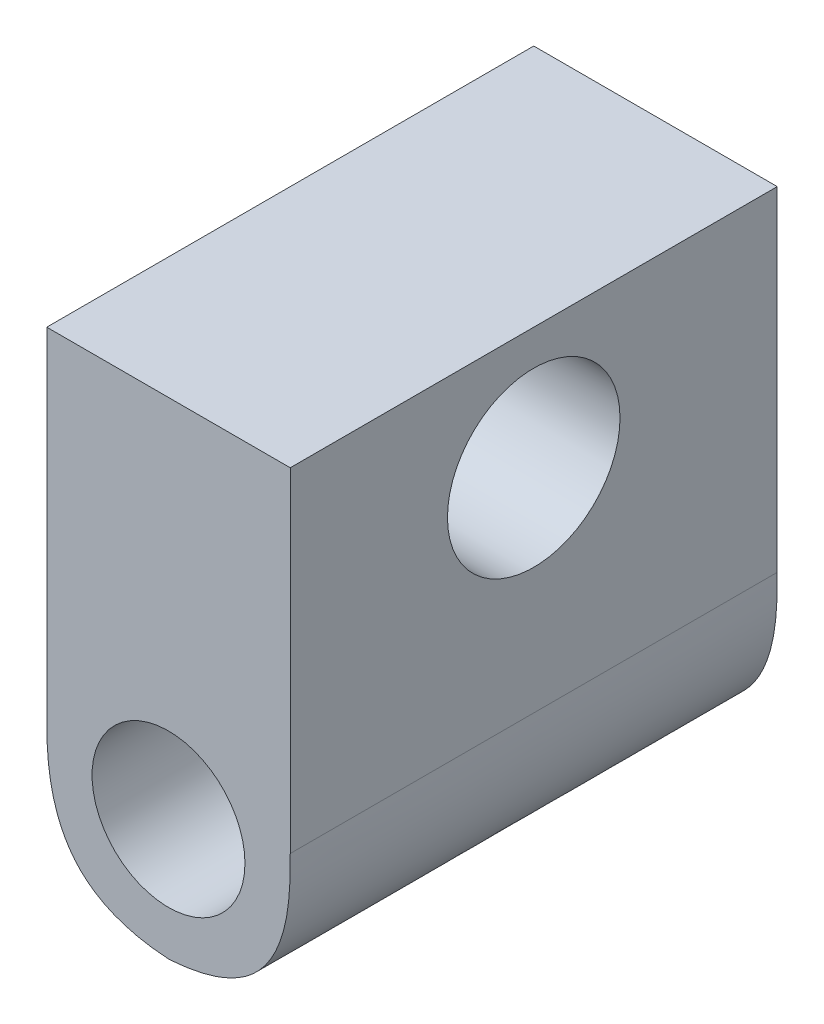
ISO-10303-21;
HEADER;
FILE_DESCRIPTION(('STEP AP214'),'2;1');
FILE_NAME('part.step','',(''),(''),'','','');
FILE_SCHEMA(('AUTOMOTIVE_DESIGN { 1 0 10303 214 1 1 1 1 }'));
ENDSEC;
DATA;
#1=APPLICATION_CONTEXT('core data for automotive mechanical design processes');
#2=APPLICATION_PROTOCOL_DEFINITION('international standard','automotive_design',2000,#1);
#3=PRODUCT_CONTEXT('',#1,'mechanical');
#4=PRODUCT('Part','Part','',(#3));
#5=PRODUCT_RELATED_PRODUCT_CATEGORY('part','',(#4));
#6=PRODUCT_DEFINITION_FORMATION('','',#4);
#7=PRODUCT_DEFINITION_CONTEXT('part definition',#1,'design');
#8=PRODUCT_DEFINITION('design','',#6,#7);
#9=PRODUCT_DEFINITION_SHAPE('','',#8);
#10=(LENGTH_UNIT() NAMED_UNIT(*) SI_UNIT(.MILLI.,.METRE.));
#11=(NAMED_UNIT(*) PLANE_ANGLE_UNIT() SI_UNIT($,.RADIAN.));
#12=(NAMED_UNIT(*) SI_UNIT($,.STERADIAN.) SOLID_ANGLE_UNIT());
#13=UNCERTAINTY_MEASURE_WITH_UNIT(LENGTH_MEASURE(1.E-05),#10,'distance_accuracy_value','');
#14=(GEOMETRIC_REPRESENTATION_CONTEXT(3) GLOBAL_UNCERTAINTY_ASSIGNED_CONTEXT((#13)) GLOBAL_UNIT_ASSIGNED_CONTEXT((#10,
#11,#12)) REPRESENTATION_CONTEXT('',''));
#15=CARTESIAN_POINT('',(0.,0.,0.));
#16=DIRECTION('',(0.,0.,1.));
#17=DIRECTION('',(1.,0.,0.));
#18=AXIS2_PLACEMENT_3D('',#15,#16,#17);
#19=CARTESIAN_POINT('',(-6.35,0.,-25.4));
#20=DIRECTION('',(1.,0.,0.));
#21=DIRECTION('',(0.,0.,-1.));
#22=AXIS2_PLACEMENT_3D('',#19,#20,#21);
#23=PLANE('',#22);
#24=CARTESIAN_POINT('',(-6.35,12.7,-12.7));
#25=DIRECTION('',(-1.,0.,0.));
#26=DIRECTION('',(0.,0.,1.));
#27=AXIS2_PLACEMENT_3D('',#24,#25,#26);
#28=CIRCLE('',#27,4.49961);
#29=CARTESIAN_POINT('',(-6.35,12.7,-8.20039));
#30=VERTEX_POINT('',#29);
#31=EDGE_CURVE('E177',#30,#30,#28,.T.);
#32=ORIENTED_EDGE('',*,*,#31,.F.);
#33=EDGE_LOOP('',(#32));
#34=FACE_BOUND('',#33,.T.);
#35=DIRECTION('',(0.,1.,0.));
#36=VECTOR('',#35,1.);
#37=CARTESIAN_POINT('',(-6.35,0.,-25.4));
#38=LINE('',#37,#36);
#39=CARTESIAN_POINT('',(-6.35,1.6256,-25.4));
#40=VERTEX_POINT('',#39);
#41=CARTESIAN_POINT('',(-6.35,19.05,-25.4));
#42=VERTEX_POINT('',#41);
#43=EDGE_CURVE('E99',#40,#42,#38,.T.);
#44=ORIENTED_EDGE('',*,*,#43,.F.);
#45=CARTESIAN_POINT('',(-6.35,1.6256,1.27));
#46=CARTESIAN_POINT('',(-6.35,1.6256,-8.04333333333333));
#47=CARTESIAN_POINT('',(-6.35,1.6256,-17.3566666666566));
#48=CARTESIAN_POINT('',(-6.35,1.6256,-26.67));
#49=B_SPLINE_CURVE_WITH_KNOTS('',3,(#45,#46,#47,#48),.UNSPECIFIED.,.F.,.F.,(4,4),(-0.02667,
0.00127),.UNSPECIFIED.);
#50=CARTESIAN_POINT('',(-6.35,1.6256,0.));
#51=VERTEX_POINT('',#50);
#52=EDGE_CURVE('E115',#40,#51,#49,.F.);
#53=ORIENTED_EDGE('',*,*,#52,.T.);
#54=DIRECTION('',(0.,1.,0.));
#55=VECTOR('',#54,1.);
#56=CARTESIAN_POINT('',(-6.35,0.,0.));
#57=LINE('',#56,#55);
#58=CARTESIAN_POINT('',(-6.35,19.05,0.));
#59=VERTEX_POINT('',#58);
#60=EDGE_CURVE('E121',#51,#59,#57,.T.);
#61=ORIENTED_EDGE('',*,*,#60,.T.);
#62=DIRECTION('',(0.,0.,1.));
#63=VECTOR('',#62,1.);
#64=CARTESIAN_POINT('',(-6.35,19.05,-25.4));
#65=LINE('',#64,#63);
#66=EDGE_CURVE('E113',#42,#59,#65,.T.);
#67=ORIENTED_EDGE('',*,*,#66,.F.);
#68=EDGE_LOOP('',(#44,#53,#61,#67));
#69=FACE_BOUND('',#68,.T.);
#70=ADVANCED_FACE('F40',(#34,#69),#23,.F.);
#71=CARTESIAN_POINT('',(0.,19.05,-25.4));
#72=DIRECTION('',(0.,-1.,0.));
#73=DIRECTION('',(0.,0.,-1.));
#74=AXIS2_PLACEMENT_3D('',#71,#72,#73);
#75=PLANE('',#74);
#76=DIRECTION('',(1.,0.,0.));
#77=VECTOR('',#76,1.);
#78=CARTESIAN_POINT('',(0.,19.05,0.));
#79=LINE('',#78,#77);
#80=CARTESIAN_POINT('',(6.35,19.05,0.));
#81=VERTEX_POINT('',#80);
#82=EDGE_CURVE('E112',#59,#81,#79,.T.);
#83=ORIENTED_EDGE('',*,*,#82,.T.);
#84=DIRECTION('',(0.,0.,1.));
#85=VECTOR('',#84,1.);
#86=CARTESIAN_POINT('',(6.35,19.05,-25.4));
#87=LINE('',#86,#85);
#88=CARTESIAN_POINT('',(6.35,19.05,-25.4));
#89=VERTEX_POINT('',#88);
#90=EDGE_CURVE('E96',#89,#81,#87,.T.);
#91=ORIENTED_EDGE('',*,*,#90,.F.);
#92=DIRECTION('',(1.,0.,0.));
#93=VECTOR('',#92,1.);
#94=CARTESIAN_POINT('',(0.,19.05,-25.4));
#95=LINE('',#94,#93);
#96=EDGE_CURVE('E98',#42,#89,#95,.T.);
#97=ORIENTED_EDGE('',*,*,#96,.F.);
#98=ORIENTED_EDGE('',*,*,#66,.T.);
#99=EDGE_LOOP('',(#83,#91,#97,#98));
#100=FACE_BOUND('',#99,.T.);
#101=ADVANCED_FACE('F110',(#100),#75,.F.);
#102=CARTESIAN_POINT('',(6.35,0.,-25.4));
#103=DIRECTION('',(1.,0.,0.));
#104=DIRECTION('',(0.,0.,-1.));
#105=AXIS2_PLACEMENT_3D('',#102,#103,#104);
#106=PLANE('',#105);
#107=CARTESIAN_POINT('',(6.35,12.7,-12.7));
#108=DIRECTION('',(1.,0.,0.));
#109=DIRECTION('',(0.,0.,-1.));
#110=AXIS2_PLACEMENT_3D('',#107,#108,#109);
#111=CIRCLE('',#110,4.49961);
#112=CARTESIAN_POINT('',(6.35,12.7,-17.19961));
#113=VERTEX_POINT('',#112);
#114=EDGE_CURVE('E125',#113,#113,#111,.F.);
#115=ORIENTED_EDGE('',*,*,#114,.T.);
#116=EDGE_LOOP('',(#115));
#117=FACE_BOUND('',#116,.T.);
#118=DIRECTION('',(0.,1.,0.));
#119=VECTOR('',#118,1.);
#120=CARTESIAN_POINT('',(6.35,0.,0.));
#121=LINE('',#120,#119);
#122=CARTESIAN_POINT('',(6.35,1.6256,0.));
#123=VERTEX_POINT('',#122);
#124=EDGE_CURVE('E124',#123,#81,#121,.T.);
#125=ORIENTED_EDGE('',*,*,#124,.F.);
#126=CARTESIAN_POINT('',(6.35,1.6256,-26.67));
#127=CARTESIAN_POINT('',(6.35,1.6256,-17.3566666666404));
#128=CARTESIAN_POINT('',(6.35,1.6256,-8.04333333333333));
#129=CARTESIAN_POINT('',(6.35,1.6256,1.27));
#130=B_SPLINE_CURVE_WITH_KNOTS('',3,(#126,#127,#128,#129),.UNSPECIFIED.,.F.,.F.,(4,4),(-0.00127,
0.02667),.UNSPECIFIED.);
#131=CARTESIAN_POINT('',(6.35,1.6256,-25.4));
#132=VERTEX_POINT('',#131);
#133=EDGE_CURVE('E11',#123,#132,#130,.F.);
#134=ORIENTED_EDGE('',*,*,#133,.T.);
#135=DIRECTION('',(0.,1.,0.));
#136=VECTOR('',#135,1.);
#137=CARTESIAN_POINT('',(6.35,0.,-25.4));
#138=LINE('',#137,#136);
#139=EDGE_CURVE('E92',#132,#89,#138,.T.);
#140=ORIENTED_EDGE('',*,*,#139,.T.);
#141=ORIENTED_EDGE('',*,*,#90,.T.);
#142=EDGE_LOOP('',(#125,#134,#140,#141));
#143=FACE_BOUND('',#142,.T.);
#144=ADVANCED_FACE('F94',(#117,#143),#106,.T.);
#145=CARTESIAN_POINT('',(0.,0.,-25.4));
#146=DIRECTION('',(0.,0.,1.));
#147=DIRECTION('',(1.,0.,0.));
#148=AXIS2_PLACEMENT_3D('',#145,#146,#147);
#149=CYLINDRICAL_SURFACE('',#148,3.9878);
#150=CARTESIAN_POINT('',(0.,0.,-25.4));
#151=DIRECTION('',(0.,0.,1.));
#152=DIRECTION('',(1.,0.,0.));
#153=AXIS2_PLACEMENT_3D('',#150,#151,#152);
#154=CIRCLE('',#153,3.9878);
#155=CARTESIAN_POINT('',(3.9878,0.,-25.4));
#156=VERTEX_POINT('',#155);
#157=EDGE_CURVE('E108',#156,#156,#154,.T.);
#158=ORIENTED_EDGE('',*,*,#157,.F.);
#159=EDGE_LOOP('',(#158));
#160=FACE_BOUND('',#159,.T.);
#161=CARTESIAN_POINT('',(0.,0.,0.));
#162=DIRECTION('',(0.,0.,1.));
#163=DIRECTION('',(1.,0.,0.));
#164=AXIS2_PLACEMENT_3D('',#161,#162,#163);
#165=CIRCLE('',#164,3.9878);
#166=CARTESIAN_POINT('',(3.9878,0.,0.));
#167=VERTEX_POINT('',#166);
#168=EDGE_CURVE('E239',#167,#167,#165,.T.);
#169=ORIENTED_EDGE('',*,*,#168,.T.);
#170=EDGE_LOOP('',(#169));
#171=FACE_BOUND('',#170,.T.);
#172=ADVANCED_FACE('F160',(#160,#171),#149,.F.);
#173=CARTESIAN_POINT('',(0.,0.,-25.4));
#174=DIRECTION('',(0.,0.,1.));
#175=DIRECTION('',(1.,0.,0.));
#176=AXIS2_PLACEMENT_3D('',#173,#174,#175);
#177=PLANE('',#176);
#178=CARTESIAN_POINT('',(-1.6256,-6.35,-25.4));
#179=CARTESIAN_POINT('',(-0.284119620185859,-6.35,-25.4));
#180=CARTESIAN_POINT('',(1.05736075962828,-6.35,-25.4));
#181=CARTESIAN_POINT('',(4.01400084403143,-5.77821392415533,-25.4));
#182=CARTESIAN_POINT('',(5.77821392415533,-4.01400084403143,-25.4));
#183=CARTESIAN_POINT('',(6.35,-1.05736075962829,-25.4));
#184=CARTESIAN_POINT('',(6.35,0.284119620185857,-25.4));
#185=CARTESIAN_POINT('',(6.35,1.6256,-25.4));
#186=B_SPLINE_CURVE_WITH_KNOTS('',5,(#178,#179,#180,#181,#182,#183,#184,#185),.UNSPECIFIED.,.F.,
.F.,(6,2,6),(0.,0.5,1.),.UNSPECIFIED.);
#187=CARTESIAN_POINT('',(-7.25062342661582E-07,-6.31444996426762,-25.4));
#188=VERTEX_POINT('',#187);
#189=EDGE_CURVE('E61',#132,#188,#186,.F.);
#190=ORIENTED_EDGE('',*,*,#189,.T.);
#191=CARTESIAN_POINT('',(-6.35,1.6256,-25.4));
#192=CARTESIAN_POINT('',(-6.35,0.284119620185856,-25.4));
#193=CARTESIAN_POINT('',(-6.35,-1.05736075962829,-25.4));
#194=CARTESIAN_POINT('',(-5.77821392415534,-4.01400084403143,-25.4));
#195=CARTESIAN_POINT('',(-4.01400084403143,-5.77821392415533,-25.4));
#196=CARTESIAN_POINT('',(-1.05736075962829,-6.35,-25.4));
#197=CARTESIAN_POINT('',(0.284119620185855,-6.35,-25.4));
#198=CARTESIAN_POINT('',(1.6256,-6.35,-25.4));
#199=B_SPLINE_CURVE_WITH_KNOTS('',5,(#191,#192,#193,#194,#195,#196,#197,#198),.UNSPECIFIED.,.F.,
.F.,(6,2,6),(0.,0.5,1.),.UNSPECIFIED.);
#200=EDGE_CURVE('E54',#188,#40,#199,.F.);
#201=ORIENTED_EDGE('',*,*,#200,.T.);
#202=ORIENTED_EDGE('',*,*,#43,.T.);
#203=ORIENTED_EDGE('',*,*,#96,.T.);
#204=ORIENTED_EDGE('',*,*,#139,.F.);
#205=EDGE_LOOP('',(#190,#201,#202,#203,#204));
#206=FACE_BOUND('',#205,.T.);
#207=ORIENTED_EDGE('',*,*,#157,.T.);
#208=EDGE_LOOP('',(#207));
#209=FACE_BOUND('',#208,.T.);
#210=ADVANCED_FACE('F102',(#206,#209),#177,.F.);
#211=CARTESIAN_POINT('',(0.,0.,0.));
#212=DIRECTION('',(0.,0.,1.));
#213=DIRECTION('',(1.,0.,0.));
#214=AXIS2_PLACEMENT_3D('',#211,#212,#213);
#215=PLANE('',#214);
#216=ORIENTED_EDGE('',*,*,#60,.F.);
#217=CARTESIAN_POINT('',(1.6256,-6.35,0.));
#218=CARTESIAN_POINT('',(0.284119620185855,-6.35,0.));
#219=CARTESIAN_POINT('',(-1.05736075962829,-6.35,0.));
#220=CARTESIAN_POINT('',(-4.01400084403143,-5.77821392415533,0.));
#221=CARTESIAN_POINT('',(-5.77821392415534,-4.01400084403143,0.));
#222=CARTESIAN_POINT('',(-6.35,-1.05736075962829,0.));
#223=CARTESIAN_POINT('',(-6.35,0.284119620185856,0.));
#224=CARTESIAN_POINT('',(-6.35,1.6256,0.));
#225=B_SPLINE_CURVE_WITH_KNOTS('',5,(#217,#218,#219,#220,#221,#222,#223,#224),.UNSPECIFIED.,.F.,
.F.,(6,2,6),(0.,0.5,1.),.UNSPECIFIED.);
#226=CARTESIAN_POINT('',(-4.50984012110351E-07,-6.31445417406302,0.));
#227=VERTEX_POINT('',#226);
#228=EDGE_CURVE('E188',#51,#227,#225,.F.);
#229=ORIENTED_EDGE('',*,*,#228,.T.);
#230=CARTESIAN_POINT('',(6.35,1.6256,0.));
#231=CARTESIAN_POINT('',(6.35,0.284119620185857,0.));
#232=CARTESIAN_POINT('',(6.35,-1.05736075962829,0.));
#233=CARTESIAN_POINT('',(5.77821392415533,-4.01400084403143,0.));
#234=CARTESIAN_POINT('',(4.01400084403143,-5.77821392415533,0.));
#235=CARTESIAN_POINT('',(1.05736075962828,-6.35,0.));
#236=CARTESIAN_POINT('',(-0.284119620185859,-6.35,0.));
#237=CARTESIAN_POINT('',(-1.6256,-6.35,0.));
#238=B_SPLINE_CURVE_WITH_KNOTS('',5,(#230,#231,#232,#233,#234,#235,#236,#237),.UNSPECIFIED.,.F.,
.F.,(6,2,6),(0.,0.5,1.),.UNSPECIFIED.);
#239=EDGE_CURVE('E141',#227,#123,#238,.F.);
#240=ORIENTED_EDGE('',*,*,#239,.T.);
#241=ORIENTED_EDGE('',*,*,#124,.T.);
#242=ORIENTED_EDGE('',*,*,#82,.F.);
#243=EDGE_LOOP('',(#216,#229,#240,#241,#242));
#244=FACE_BOUND('',#243,.T.);
#245=ORIENTED_EDGE('',*,*,#168,.F.);
#246=EDGE_LOOP('',(#245));
#247=FACE_BOUND('',#246,.T.);
#248=ADVANCED_FACE('F147',(#244,#247),#215,.T.);
#249=CARTESIAN_POINT('',(19.0768189747792,12.7,-12.7));
#250=DIRECTION('',(-1.,0.,0.));
#251=DIRECTION('',(0.,0.,1.));
#252=AXIS2_PLACEMENT_3D('',#249,#250,#251);
#253=CYLINDRICAL_SURFACE('',#252,4.49961);
#254=ORIENTED_EDGE('',*,*,#31,.T.);
#255=EDGE_LOOP('',(#254));
#256=FACE_BOUND('',#255,.T.);
#257=ORIENTED_EDGE('',*,*,#114,.F.);
#258=EDGE_LOOP('',(#257));
#259=FACE_BOUND('',#258,.T.);
#260=ADVANCED_FACE('F157',(#256,#259),#253,.F.);
#261=CARTESIAN_POINT('',(-1.6256,-6.35,-26.67));
#262=CARTESIAN_POINT('',(-1.6256,-6.35,-17.3566666666404));
#263=CARTESIAN_POINT('',(-1.6256,-6.35,-8.04333333333333));
#264=CARTESIAN_POINT('',(-1.6256,-6.35,1.27));
#265=CARTESIAN_POINT('',(-0.284119620185859,-6.35,-26.67));
#266=CARTESIAN_POINT('',(-0.284119620185859,-6.35,-17.3566666666404));
#267=CARTESIAN_POINT('',(-0.284119620185859,-6.35,-8.04333333333333));
#268=CARTESIAN_POINT('',(-0.284119620185859,-6.35,1.27));
#269=CARTESIAN_POINT('',(1.05736075962828,-6.35,-26.67));
#270=CARTESIAN_POINT('',(1.05736075962828,-6.35,-17.3566666666404));
#271=CARTESIAN_POINT('',(1.05736075962828,-6.35,-8.04333333333333));
#272=CARTESIAN_POINT('',(1.05736075962828,-6.35,1.27));
#273=CARTESIAN_POINT('',(4.01400084403143,-5.77821392415533,-26.67));
#274=CARTESIAN_POINT('',(4.01400084403143,-5.77821392415533,-17.3566666666404));
#275=CARTESIAN_POINT('',(4.01400084403143,-5.77821392415533,-8.04333333333333));
#276=CARTESIAN_POINT('',(4.01400084403143,-5.77821392415533,1.27));
#277=CARTESIAN_POINT('',(5.77821392415533,-4.01400084403143,-26.67));
#278=CARTESIAN_POINT('',(5.77821392415533,-4.01400084403143,-17.3566666666404));
#279=CARTESIAN_POINT('',(5.77821392415533,-4.01400084403143,-8.04333333333333));
#280=CARTESIAN_POINT('',(5.77821392415533,-4.01400084403143,1.27));
#281=CARTESIAN_POINT('',(6.35,-1.05736075962829,-26.67));
#282=CARTESIAN_POINT('',(6.35,-1.05736075962829,-17.3566666666404));
#283=CARTESIAN_POINT('',(6.35,-1.05736075962829,-8.04333333333333));
#284=CARTESIAN_POINT('',(6.35,-1.05736075962829,1.27));
#285=CARTESIAN_POINT('',(6.35,0.284119620185857,-26.67));
#286=CARTESIAN_POINT('',(6.35,0.284119620185857,-17.3566666666404));
#287=CARTESIAN_POINT('',(6.35,0.284119620185857,-8.04333333333333));
#288=CARTESIAN_POINT('',(6.35,0.284119620185857,1.27));
#289=CARTESIAN_POINT('',(6.35,1.6256,-26.67));
#290=CARTESIAN_POINT('',(6.35,1.6256,-17.3566666666404));
#291=CARTESIAN_POINT('',(6.35,1.6256,-8.04333333333333));
#292=CARTESIAN_POINT('',(6.35,1.6256,1.27));
#293=B_SPLINE_SURFACE_WITH_KNOTS('',5,3,((#261,#262,#263,#264),(#265,#266,#267,#268),(#269,#270,
#271,#272),(#273,#274,#275,#276),(#277,#278,#279,#280),(#281,#282,#283,#284),(#285,#286,#287,
#288),(#289,#290,#291,#292)),.UNSPECIFIED.,.F.,.F.,.F.,(6,2,6),(4,4),(0.,0.5,1.),(-0.00127,
0.02667),.UNSPECIFIED.);
#294=CARTESIAN_POINT('',(0.,-6.31446149156776,-26.67));
#295=CARTESIAN_POINT('',(0.,-6.31446149156776,-17.3566666666566));
#296=CARTESIAN_POINT('',(0.,-6.31446149156776,-8.04333333333333));
#297=CARTESIAN_POINT('',(0.,-6.31446149156776,1.27));
#298=B_SPLINE_CURVE_WITH_KNOTS('',3,(#294,#295,#296,#297),.UNSPECIFIED.,.F.,.F.,(4,4),(-0.02667,
0.00127),.UNSPECIFIED.);
#299=EDGE_CURVE('E179',#188,#227,#298,.T.);
#300=ORIENTED_EDGE('',*,*,#299,.F.);
#301=ORIENTED_EDGE('',*,*,#189,.F.);
#302=ORIENTED_EDGE('',*,*,#133,.F.);
#303=ORIENTED_EDGE('',*,*,#239,.F.);
#304=EDGE_LOOP('',(#300,#301,#302,#303));
#305=FACE_BOUND('',#304,.T.);
#306=ADVANCED_FACE('F43',(#305),#293,.T.);
#307=CARTESIAN_POINT('',(1.6256,-6.35,1.27));
#308=CARTESIAN_POINT('',(1.6256,-6.35,-8.04333333333333));
#309=CARTESIAN_POINT('',(1.6256,-6.35,-17.3566666666566));
#310=CARTESIAN_POINT('',(1.6256,-6.35,-26.67));
#311=CARTESIAN_POINT('',(0.284119620185855,-6.35,1.27));
#312=CARTESIAN_POINT('',(0.284119620185855,-6.35,-8.04333333333333));
#313=CARTESIAN_POINT('',(0.284119620185855,-6.35,-17.3566666666566));
#314=CARTESIAN_POINT('',(0.284119620185855,-6.35,-26.67));
#315=CARTESIAN_POINT('',(-1.05736075962829,-6.35,1.27));
#316=CARTESIAN_POINT('',(-1.05736075962829,-6.35,-8.04333333333333));
#317=CARTESIAN_POINT('',(-1.05736075962829,-6.35,-17.3566666666566));
#318=CARTESIAN_POINT('',(-1.05736075962829,-6.35,-26.67));
#319=CARTESIAN_POINT('',(-4.01400084403143,-5.77821392415533,1.27));
#320=CARTESIAN_POINT('',(-4.01400084403143,-5.77821392415533,-8.04333333333333));
#321=CARTESIAN_POINT('',(-4.01400084403143,-5.77821392415533,-17.3566666666566));
#322=CARTESIAN_POINT('',(-4.01400084403143,-5.77821392415533,-26.67));
#323=CARTESIAN_POINT('',(-5.77821392415534,-4.01400084403143,1.27));
#324=CARTESIAN_POINT('',(-5.77821392415534,-4.01400084403143,-8.04333333333333));
#325=CARTESIAN_POINT('',(-5.77821392415534,-4.01400084403143,-17.3566666666566));
#326=CARTESIAN_POINT('',(-5.77821392415534,-4.01400084403143,-26.67));
#327=CARTESIAN_POINT('',(-6.35,-1.05736075962829,1.27));
#328=CARTESIAN_POINT('',(-6.35,-1.05736075962829,-8.04333333333333));
#329=CARTESIAN_POINT('',(-6.35,-1.05736075962829,-17.3566666666566));
#330=CARTESIAN_POINT('',(-6.35,-1.05736075962829,-26.67));
#331=CARTESIAN_POINT('',(-6.35,0.284119620185856,1.27));
#332=CARTESIAN_POINT('',(-6.35,0.284119620185856,-8.04333333333333));
#333=CARTESIAN_POINT('',(-6.35,0.284119620185856,-17.3566666666566));
#334=CARTESIAN_POINT('',(-6.35,0.284119620185856,-26.67));
#335=CARTESIAN_POINT('',(-6.35,1.6256,1.27));
#336=CARTESIAN_POINT('',(-6.35,1.6256,-8.04333333333333));
#337=CARTESIAN_POINT('',(-6.35,1.6256,-17.3566666666566));
#338=CARTESIAN_POINT('',(-6.35,1.6256,-26.67));
#339=B_SPLINE_SURFACE_WITH_KNOTS('',5,3,((#307,#308,#309,#310),(#311,#312,#313,#314),(#315,#316,
#317,#318),(#319,#320,#321,#322),(#323,#324,#325,#326),(#327,#328,#329,#330),(#331,#332,#333,
#334),(#335,#336,#337,#338)),.UNSPECIFIED.,.F.,.F.,.F.,(6,2,6),(4,4),(0.,0.5,1.),(-0.02667,
0.00127),.UNSPECIFIED.);
#340=ORIENTED_EDGE('',*,*,#200,.F.);
#341=ORIENTED_EDGE('',*,*,#299,.T.);
#342=ORIENTED_EDGE('',*,*,#228,.F.);
#343=ORIENTED_EDGE('',*,*,#52,.F.);
#344=EDGE_LOOP('',(#340,#341,#342,#343));
#345=FACE_BOUND('',#344,.T.);
#346=ADVANCED_FACE('F186',(#345),#339,.T.);
#347=CLOSED_SHELL('',(#70,#101,#144,#172,#210,#248,#260,#306,#346));
#348=MANIFOLD_SOLID_BREP('B2',#347);
#349=ADVANCED_BREP_SHAPE_REPRESENTATION('',(#18,#348),#14);
#350=SHAPE_DEFINITION_REPRESENTATION(#9,#349);
ENDSEC;
END-ISO-10303-21;
